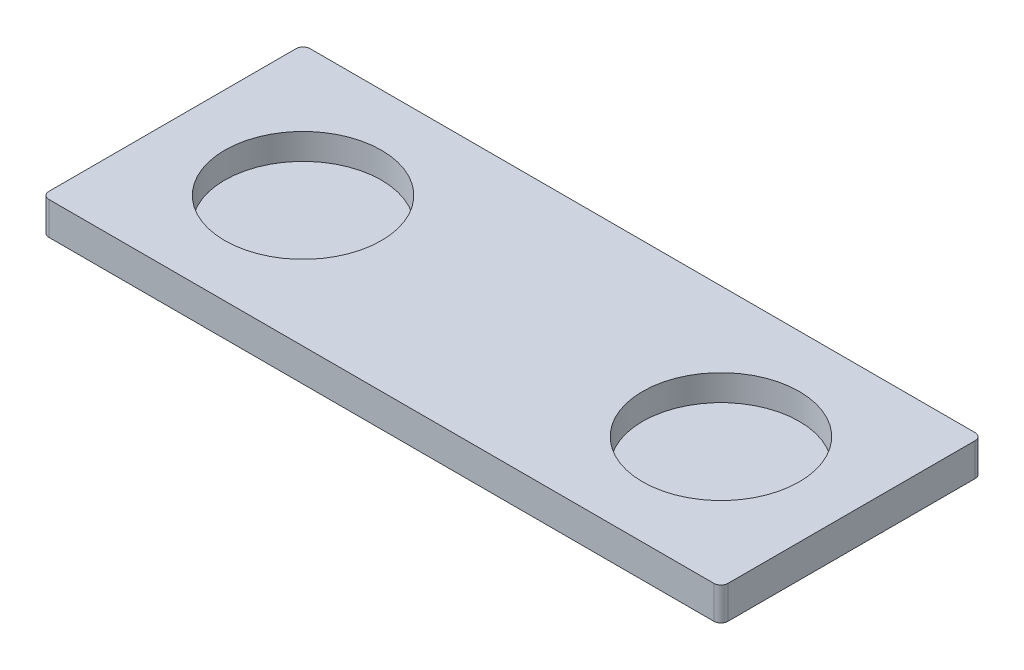
ISO-10303-21;
HEADER;
FILE_DESCRIPTION(('STEP AP214'),'2;1');
FILE_NAME('part.step','',(''),(''),'','','');
FILE_SCHEMA(('AUTOMOTIVE_DESIGN { 1 0 10303 214 1 1 1 1 }'));
ENDSEC;
DATA;
#1=APPLICATION_CONTEXT('core data for automotive mechanical design processes');
#2=APPLICATION_PROTOCOL_DEFINITION('international standard','automotive_design',2000,#1);
#3=PRODUCT_CONTEXT('',#1,'mechanical');
#4=PRODUCT('Part','Part','',(#3));
#5=PRODUCT_RELATED_PRODUCT_CATEGORY('part','',(#4));
#6=PRODUCT_DEFINITION_FORMATION('','',#4);
#7=PRODUCT_DEFINITION_CONTEXT('part definition',#1,'design');
#8=PRODUCT_DEFINITION('design','',#6,#7);
#9=PRODUCT_DEFINITION_SHAPE('','',#8);
#10=(LENGTH_UNIT() NAMED_UNIT(*) SI_UNIT(.MILLI.,.METRE.));
#11=(NAMED_UNIT(*) PLANE_ANGLE_UNIT() SI_UNIT($,.RADIAN.));
#12=(NAMED_UNIT(*) SI_UNIT($,.STERADIAN.) SOLID_ANGLE_UNIT());
#13=UNCERTAINTY_MEASURE_WITH_UNIT(LENGTH_MEASURE(1.E-05),#10,'distance_accuracy_value','');
#14=(GEOMETRIC_REPRESENTATION_CONTEXT(3) GLOBAL_UNCERTAINTY_ASSIGNED_CONTEXT((#13)) GLOBAL_UNIT_ASSIGNED_CONTEXT((#10,
#11,#12)) REPRESENTATION_CONTEXT('',''));
#15=CARTESIAN_POINT('',(0.,0.,0.));
#16=DIRECTION('',(0.,0.,1.));
#17=DIRECTION('',(1.,0.,0.));
#18=AXIS2_PLACEMENT_3D('',#15,#16,#17);
#19=CARTESIAN_POINT('',(76.2,2.54,0.));
#20=DIRECTION('',(0.,-1.,0.));
#21=DIRECTION('',(0.,0.,-1.));
#22=AXIS2_PLACEMENT_3D('',#19,#20,#21);
#23=PLANE('',#22);
#24=CARTESIAN_POINT('',(76.2,2.54,0.));
#25=DIRECTION('',(0.,1.,0.));
#26=DIRECTION('',(0.,0.,1.));
#27=AXIS2_PLACEMENT_3D('',#24,#25,#26);
#28=CIRCLE('',#27,28.575);
#29=CARTESIAN_POINT('',(76.2,2.54,28.575));
#30=VERTEX_POINT('',#29);
#31=EDGE_CURVE('E20',#30,#30,#28,.T.);
#32=ORIENTED_EDGE('',*,*,#31,.T.);
#33=EDGE_LOOP('',(#32));
#34=FACE_BOUND('',#33,.T.);
#35=ADVANCED_FACE('F17',(#34),#23,.F.);
#36=CARTESIAN_POINT('',(-76.2,2.54,0.));
#37=DIRECTION('',(0.,-1.,0.));
#38=DIRECTION('',(0.,0.,-1.));
#39=AXIS2_PLACEMENT_3D('',#36,#37,#38);
#40=PLANE('',#39);
#41=CARTESIAN_POINT('',(-76.2,2.54,0.));
#42=DIRECTION('',(0.,1.,0.));
#43=DIRECTION('',(0.,0.,1.));
#44=AXIS2_PLACEMENT_3D('',#41,#42,#43);
#45=CIRCLE('',#44,28.575);
#46=CARTESIAN_POINT('',(-76.2,2.54,28.575));
#47=VERTEX_POINT('',#46);
#48=EDGE_CURVE('E140',#47,#47,#45,.T.);
#49=ORIENTED_EDGE('',*,*,#48,.T.);
#50=EDGE_LOOP('',(#49));
#51=FACE_BOUND('',#50,.T.);
#52=ADVANCED_FACE('F151',(#51),#40,.F.);
#53=CARTESIAN_POINT('',(76.2,0.,0.));
#54=DIRECTION('',(0.,1.,0.));
#55=DIRECTION('',(0.,0.,1.));
#56=AXIS2_PLACEMENT_3D('',#53,#54,#55);
#57=CYLINDRICAL_SURFACE('',#56,28.575);
#58=CARTESIAN_POINT('',(76.2,12.,0.));
#59=DIRECTION('',(0.,1.,0.));
#60=DIRECTION('',(0.,0.,1.));
#61=AXIS2_PLACEMENT_3D('',#58,#59,#60);
#62=CIRCLE('',#61,28.575);
#63=CARTESIAN_POINT('',(76.2,12.,28.575));
#64=VERTEX_POINT('',#63);
#65=EDGE_CURVE('E138',#64,#64,#62,.F.);
#66=ORIENTED_EDGE('',*,*,#65,.F.);
#67=EDGE_LOOP('',(#66));
#68=FACE_BOUND('',#67,.T.);
#69=ORIENTED_EDGE('',*,*,#31,.F.);
#70=EDGE_LOOP('',(#69));
#71=FACE_BOUND('',#70,.T.);
#72=ADVANCED_FACE('F148',(#68,#71),#57,.F.);
#73=CARTESIAN_POINT('',(-76.2,0.,0.));
#74=DIRECTION('',(0.,1.,0.));
#75=DIRECTION('',(0.,0.,1.));
#76=AXIS2_PLACEMENT_3D('',#73,#74,#75);
#77=CYLINDRICAL_SURFACE('',#76,28.575);
#78=CARTESIAN_POINT('',(-76.2,12.,0.));
#79=DIRECTION('',(0.,1.,0.));
#80=DIRECTION('',(0.,0.,1.));
#81=AXIS2_PLACEMENT_3D('',#78,#79,#80);
#82=CIRCLE('',#81,28.575);
#83=CARTESIAN_POINT('',(-76.2,12.,28.575));
#84=VERTEX_POINT('',#83);
#85=EDGE_CURVE('E93',#84,#84,#82,.F.);
#86=ORIENTED_EDGE('',*,*,#85,.F.);
#87=EDGE_LOOP('',(#86));
#88=FACE_BOUND('',#87,.T.);
#89=ORIENTED_EDGE('',*,*,#48,.F.);
#90=EDGE_LOOP('',(#89));
#91=FACE_BOUND('',#90,.T.);
#92=ADVANCED_FACE('F150',(#88,#91),#77,.F.);
#93=CARTESIAN_POINT('',(0.,12.,0.));
#94=DIRECTION('',(0.,1.,0.));
#95=DIRECTION('',(0.,0.,1.));
#96=AXIS2_PLACEMENT_3D('',#93,#94,#95);
#97=PLANE('',#96);
#98=DIRECTION('',(0.,0.,1.));
#99=VECTOR('',#98,1.);
#100=CARTESIAN_POINT('',(123.825,12.,47.625));
#101=LINE('',#100,#99);
#102=CARTESIAN_POINT('',(123.825,12.,45.085));
#103=VERTEX_POINT('',#102);
#104=CARTESIAN_POINT('',(123.825,12.,-45.085));
#105=VERTEX_POINT('',#104);
#106=EDGE_CURVE('E115',#103,#105,#101,.F.);
#107=ORIENTED_EDGE('',*,*,#106,.T.);
#108=CARTESIAN_POINT('',(121.285,12.,-45.085));
#109=DIRECTION('',(0.,-1.,0.));
#110=DIRECTION('',(0.,0.,-1.));
#111=AXIS2_PLACEMENT_3D('',#108,#109,#110);
#112=CIRCLE('',#111,2.54);
#113=CARTESIAN_POINT('',(121.285,12.,-47.625));
#114=VERTEX_POINT('',#113);
#115=EDGE_CURVE('E116',#114,#105,#112,.T.);
#116=ORIENTED_EDGE('',*,*,#115,.F.);
#117=DIRECTION('',(1.,0.,0.));
#118=VECTOR('',#117,1.);
#119=CARTESIAN_POINT('',(123.825,12.,-47.625));
#120=LINE('',#119,#118);
#121=CARTESIAN_POINT('',(-121.285,12.,-47.625));
#122=VERTEX_POINT('',#121);
#123=EDGE_CURVE('E110',#114,#122,#120,.F.);
#124=ORIENTED_EDGE('',*,*,#123,.T.);
#125=CARTESIAN_POINT('',(-121.285,12.,-45.085));
#126=DIRECTION('',(0.,-1.,0.));
#127=DIRECTION('',(0.,0.,-1.));
#128=AXIS2_PLACEMENT_3D('',#125,#126,#127);
#129=CIRCLE('',#128,2.54);
#130=CARTESIAN_POINT('',(-123.825,12.,-45.085));
#131=VERTEX_POINT('',#130);
#132=EDGE_CURVE('E113',#131,#122,#129,.T.);
#133=ORIENTED_EDGE('',*,*,#132,.F.);
#134=DIRECTION('',(0.,0.,-1.));
#135=VECTOR('',#134,1.);
#136=CARTESIAN_POINT('',(-123.825,12.,47.625));
#137=LINE('',#136,#135);
#138=CARTESIAN_POINT('',(-123.825,12.,45.085));
#139=VERTEX_POINT('',#138);
#140=EDGE_CURVE('E87',#131,#139,#137,.F.);
#141=ORIENTED_EDGE('',*,*,#140,.T.);
#142=CARTESIAN_POINT('',(-121.285,12.,45.085));
#143=DIRECTION('',(0.,-1.,0.));
#144=DIRECTION('',(0.,0.,-1.));
#145=AXIS2_PLACEMENT_3D('',#142,#143,#144);
#146=CIRCLE('',#145,2.54);
#147=CARTESIAN_POINT('',(-121.285,12.,47.625));
#148=VERTEX_POINT('',#147);
#149=EDGE_CURVE('E80',#148,#139,#146,.T.);
#150=ORIENTED_EDGE('',*,*,#149,.F.);
#151=DIRECTION('',(-1.,0.,0.));
#152=VECTOR('',#151,1.);
#153=CARTESIAN_POINT('',(123.825,12.,47.625));
#154=LINE('',#153,#152);
#155=CARTESIAN_POINT('',(121.285,12.,47.625));
#156=VERTEX_POINT('',#155);
#157=EDGE_CURVE('E85',#148,#156,#154,.F.);
#158=ORIENTED_EDGE('',*,*,#157,.T.);
#159=CARTESIAN_POINT('',(121.285,12.,45.085));
#160=DIRECTION('',(0.,-1.,0.));
#161=DIRECTION('',(0.,0.,-1.));
#162=AXIS2_PLACEMENT_3D('',#159,#160,#161);
#163=CIRCLE('',#162,2.54);
#164=EDGE_CURVE('E100',#103,#156,#163,.T.);
#165=ORIENTED_EDGE('',*,*,#164,.F.);
#166=EDGE_LOOP('',(#107,#116,#124,#133,#141,#150,#158,#165));
#167=FACE_BOUND('',#166,.T.);
#168=ORIENTED_EDGE('',*,*,#85,.T.);
#169=EDGE_LOOP('',(#168));
#170=FACE_BOUND('',#169,.T.);
#171=ORIENTED_EDGE('',*,*,#65,.T.);
#172=EDGE_LOOP('',(#171));
#173=FACE_BOUND('',#172,.T.);
#174=ADVANCED_FACE('F83',(#167,#170,#173),#97,.T.);
#175=CARTESIAN_POINT('',(-121.285,12.,45.085));
#176=DIRECTION('',(0.,-1.,0.));
#177=DIRECTION('',(0.,0.,-1.));
#178=AXIS2_PLACEMENT_3D('',#175,#176,#177);
#179=CYLINDRICAL_SURFACE('',#178,2.54);
#180=CARTESIAN_POINT('',(-121.285,0.,45.085));
#181=DIRECTION('',(0.,-1.,0.));
#182=DIRECTION('',(0.,0.,-1.));
#183=AXIS2_PLACEMENT_3D('',#180,#181,#182);
#184=CIRCLE('',#183,2.54);
#185=CARTESIAN_POINT('',(-123.825,0.,45.085));
#186=VERTEX_POINT('',#185);
#187=CARTESIAN_POINT('',(-121.285,0.,47.625));
#188=VERTEX_POINT('',#187);
#189=EDGE_CURVE('E104',#186,#188,#184,.F.);
#190=ORIENTED_EDGE('',*,*,#189,.T.);
#191=DIRECTION('',(0.,1.,0.));
#192=VECTOR('',#191,1.);
#193=CARTESIAN_POINT('',(-121.285,12.,47.625));
#194=LINE('',#193,#192);
#195=EDGE_CURVE('E92',#188,#148,#194,.T.);
#196=ORIENTED_EDGE('',*,*,#195,.T.);
#197=ORIENTED_EDGE('',*,*,#149,.T.);
#198=DIRECTION('',(0.,1.,0.));
#199=VECTOR('',#198,1.);
#200=CARTESIAN_POINT('',(-123.825,12.,45.085));
#201=LINE('',#200,#199);
#202=EDGE_CURVE('E296',#139,#186,#201,.F.);
#203=ORIENTED_EDGE('',*,*,#202,.T.);
#204=EDGE_LOOP('',(#190,#196,#197,#203));
#205=FACE_BOUND('',#204,.T.);
#206=ADVANCED_FACE('F103',(#205),#179,.T.);
#207=CARTESIAN_POINT('',(123.825,12.,47.625));
#208=DIRECTION('',(0.,0.,-1.));
#209=DIRECTION('',(-1.,0.,0.));
#210=AXIS2_PLACEMENT_3D('',#207,#208,#209);
#211=PLANE('',#210);
#212=ORIENTED_EDGE('',*,*,#195,.F.);
#213=DIRECTION('',(1.,0.,0.));
#214=VECTOR('',#213,1.);
#215=CARTESIAN_POINT('',(0.,0.,47.625));
#216=LINE('',#215,#214);
#217=CARTESIAN_POINT('',(121.285,0.,47.625));
#218=VERTEX_POINT('',#217);
#219=EDGE_CURVE('E129',#188,#218,#216,.T.);
#220=ORIENTED_EDGE('',*,*,#219,.T.);
#221=DIRECTION('',(0.,-1.,0.));
#222=VECTOR('',#221,1.);
#223=CARTESIAN_POINT('',(121.285,12.,47.625));
#224=LINE('',#223,#222);
#225=EDGE_CURVE('E99',#156,#218,#224,.T.);
#226=ORIENTED_EDGE('',*,*,#225,.F.);
#227=ORIENTED_EDGE('',*,*,#157,.F.);
#228=EDGE_LOOP('',(#212,#220,#226,#227));
#229=FACE_BOUND('',#228,.T.);
#230=ADVANCED_FACE('F96',(#229),#211,.F.);
#231=CARTESIAN_POINT('',(121.285,12.,45.085));
#232=DIRECTION('',(0.,-1.,0.));
#233=DIRECTION('',(0.,0.,-1.));
#234=AXIS2_PLACEMENT_3D('',#231,#232,#233);
#235=CYLINDRICAL_SURFACE('',#234,2.54);
#236=CARTESIAN_POINT('',(121.285,0.,45.085));
#237=DIRECTION('',(0.,-1.,0.));
#238=DIRECTION('',(0.,0.,-1.));
#239=AXIS2_PLACEMENT_3D('',#236,#237,#238);
#240=CIRCLE('',#239,2.54);
#241=CARTESIAN_POINT('',(123.825,0.,45.085));
#242=VERTEX_POINT('',#241);
#243=EDGE_CURVE('E126',#218,#242,#240,.F.);
#244=ORIENTED_EDGE('',*,*,#243,.T.);
#245=DIRECTION('',(0.,1.,0.));
#246=VECTOR('',#245,1.);
#247=CARTESIAN_POINT('',(123.825,12.,45.085));
#248=LINE('',#247,#246);
#249=EDGE_CURVE('E117',#242,#103,#248,.T.);
#250=ORIENTED_EDGE('',*,*,#249,.T.);
#251=ORIENTED_EDGE('',*,*,#164,.T.);
#252=ORIENTED_EDGE('',*,*,#225,.T.);
#253=EDGE_LOOP('',(#244,#250,#251,#252));
#254=FACE_BOUND('',#253,.T.);
#255=ADVANCED_FACE('F188',(#254),#235,.T.);
#256=CARTESIAN_POINT('',(123.825,12.,47.625));
#257=DIRECTION('',(-1.,0.,0.));
#258=DIRECTION('',(0.,0.,1.));
#259=AXIS2_PLACEMENT_3D('',#256,#257,#258);
#260=PLANE('',#259);
#261=DIRECTION('',(0.,-1.,0.));
#262=VECTOR('',#261,1.);
#263=CARTESIAN_POINT('',(123.825,12.,-45.085));
#264=LINE('',#263,#262);
#265=CARTESIAN_POINT('',(123.825,0.,-45.085));
#266=VERTEX_POINT('',#265);
#267=EDGE_CURVE('E134',#105,#266,#264,.T.);
#268=ORIENTED_EDGE('',*,*,#267,.F.);
#269=ORIENTED_EDGE('',*,*,#106,.F.);
#270=ORIENTED_EDGE('',*,*,#249,.F.);
#271=DIRECTION('',(0.,0.,1.));
#272=VECTOR('',#271,1.);
#273=CARTESIAN_POINT('',(123.825,0.,0.));
#274=LINE('',#273,#272);
#275=EDGE_CURVE('E125',#242,#266,#274,.F.);
#276=ORIENTED_EDGE('',*,*,#275,.T.);
#277=EDGE_LOOP('',(#268,#269,#270,#276));
#278=FACE_BOUND('',#277,.T.);
#279=ADVANCED_FACE('F184',(#278),#260,.F.);
#280=CARTESIAN_POINT('',(121.285,12.,-45.085));
#281=DIRECTION('',(0.,-1.,0.));
#282=DIRECTION('',(0.,0.,-1.));
#283=AXIS2_PLACEMENT_3D('',#280,#281,#282);
#284=CYLINDRICAL_SURFACE('',#283,2.54);
#285=CARTESIAN_POINT('',(121.285,0.,-45.085));
#286=DIRECTION('',(0.,-1.,0.));
#287=DIRECTION('',(0.,0.,-1.));
#288=AXIS2_PLACEMENT_3D('',#285,#286,#287);
#289=CIRCLE('',#288,2.54);
#290=CARTESIAN_POINT('',(121.285,0.,-47.625));
#291=VERTEX_POINT('',#290);
#292=EDGE_CURVE('E122',#266,#291,#289,.F.);
#293=ORIENTED_EDGE('',*,*,#292,.T.);
#294=DIRECTION('',(0.,1.,0.));
#295=VECTOR('',#294,1.);
#296=CARTESIAN_POINT('',(121.285,12.,-47.625));
#297=LINE('',#296,#295);
#298=EDGE_CURVE('E114',#291,#114,#297,.T.);
#299=ORIENTED_EDGE('',*,*,#298,.T.);
#300=ORIENTED_EDGE('',*,*,#115,.T.);
#301=ORIENTED_EDGE('',*,*,#267,.T.);
#302=EDGE_LOOP('',(#293,#299,#300,#301));
#303=FACE_BOUND('',#302,.T.);
#304=ADVANCED_FACE('F180',(#303),#284,.T.);
#305=CARTESIAN_POINT('',(123.825,12.,-47.625));
#306=DIRECTION('',(0.,0.,1.));
#307=DIRECTION('',(1.,0.,0.));
#308=AXIS2_PLACEMENT_3D('',#305,#306,#307);
#309=PLANE('',#308);
#310=DIRECTION('',(0.,-1.,0.));
#311=VECTOR('',#310,1.);
#312=CARTESIAN_POINT('',(-121.285,12.,-47.625));
#313=LINE('',#312,#311);
#314=CARTESIAN_POINT('',(-121.285,0.,-47.625));
#315=VERTEX_POINT('',#314);
#316=EDGE_CURVE('E132',#122,#315,#313,.T.);
#317=ORIENTED_EDGE('',*,*,#316,.F.);
#318=ORIENTED_EDGE('',*,*,#123,.F.);
#319=ORIENTED_EDGE('',*,*,#298,.F.);
#320=DIRECTION('',(1.,0.,0.));
#321=VECTOR('',#320,1.);
#322=CARTESIAN_POINT('',(0.,0.,-47.625));
#323=LINE('',#322,#321);
#324=EDGE_CURVE('E121',#291,#315,#323,.F.);
#325=ORIENTED_EDGE('',*,*,#324,.T.);
#326=EDGE_LOOP('',(#317,#318,#319,#325));
#327=FACE_BOUND('',#326,.T.);
#328=ADVANCED_FACE('F176',(#327),#309,.F.);
#329=CARTESIAN_POINT('',(-121.285,12.,-45.085));
#330=DIRECTION('',(0.,-1.,0.));
#331=DIRECTION('',(0.,0.,-1.));
#332=AXIS2_PLACEMENT_3D('',#329,#330,#331);
#333=CYLINDRICAL_SURFACE('',#332,2.54);
#334=CARTESIAN_POINT('',(-121.285,0.,-45.085));
#335=DIRECTION('',(0.,-1.,0.));
#336=DIRECTION('',(0.,0.,-1.));
#337=AXIS2_PLACEMENT_3D('',#334,#335,#336);
#338=CIRCLE('',#337,2.54);
#339=CARTESIAN_POINT('',(-123.825,0.,-45.085));
#340=VERTEX_POINT('',#339);
#341=EDGE_CURVE('E26',#315,#340,#338,.F.);
#342=ORIENTED_EDGE('',*,*,#341,.T.);
#343=DIRECTION('',(0.,1.,0.));
#344=VECTOR('',#343,1.);
#345=CARTESIAN_POINT('',(-123.825,12.,-45.085));
#346=LINE('',#345,#344);
#347=EDGE_CURVE('E34',#340,#131,#346,.T.);
#348=ORIENTED_EDGE('',*,*,#347,.T.);
#349=ORIENTED_EDGE('',*,*,#132,.T.);
#350=ORIENTED_EDGE('',*,*,#316,.T.);
#351=EDGE_LOOP('',(#342,#348,#349,#350));
#352=FACE_BOUND('',#351,.T.);
#353=ADVANCED_FACE('F170',(#352),#333,.T.);
#354=CARTESIAN_POINT('',(-123.825,12.,47.625));
#355=DIRECTION('',(1.,0.,0.));
#356=DIRECTION('',(0.,0.,-1.));
#357=AXIS2_PLACEMENT_3D('',#354,#355,#356);
#358=PLANE('',#357);
#359=ORIENTED_EDGE('',*,*,#347,.F.);
#360=DIRECTION('',(0.,0.,1.));
#361=VECTOR('',#360,1.);
#362=CARTESIAN_POINT('',(-123.825,0.,0.));
#363=LINE('',#362,#361);
#364=EDGE_CURVE('E11',#340,#186,#363,.T.);
#365=ORIENTED_EDGE('',*,*,#364,.T.);
#366=ORIENTED_EDGE('',*,*,#202,.F.);
#367=ORIENTED_EDGE('',*,*,#140,.F.);
#368=EDGE_LOOP('',(#359,#365,#366,#367));
#369=FACE_BOUND('',#368,.T.);
#370=ADVANCED_FACE('F164',(#369),#358,.F.);
#371=CARTESIAN_POINT('',(0.,0.,0.));
#372=DIRECTION('',(0.,1.,0.));
#373=DIRECTION('',(0.,0.,1.));
#374=AXIS2_PLACEMENT_3D('',#371,#372,#373);
#375=PLANE('',#374);
#376=ORIENTED_EDGE('',*,*,#341,.F.);
#377=ORIENTED_EDGE('',*,*,#324,.F.);
#378=ORIENTED_EDGE('',*,*,#292,.F.);
#379=ORIENTED_EDGE('',*,*,#275,.F.);
#380=ORIENTED_EDGE('',*,*,#243,.F.);
#381=ORIENTED_EDGE('',*,*,#219,.F.);
#382=ORIENTED_EDGE('',*,*,#189,.F.);
#383=ORIENTED_EDGE('',*,*,#364,.F.);
#384=EDGE_LOOP('',(#376,#377,#378,#379,#380,#381,#382,#383));
#385=FACE_BOUND('',#384,.T.);
#386=ADVANCED_FACE('F162',(#385),#375,.F.);
#387=CLOSED_SHELL('',(#35,#52,#72,#92,#174,#206,#230,#255,#279,#304,#328,#353,#370,#386));
#388=MANIFOLD_SOLID_BREP('B1',#387);
#389=ADVANCED_BREP_SHAPE_REPRESENTATION('',(#18,#388),#14);
#390=SHAPE_DEFINITION_REPRESENTATION(#9,#389);
ENDSEC;
END-ISO-10303-21;
